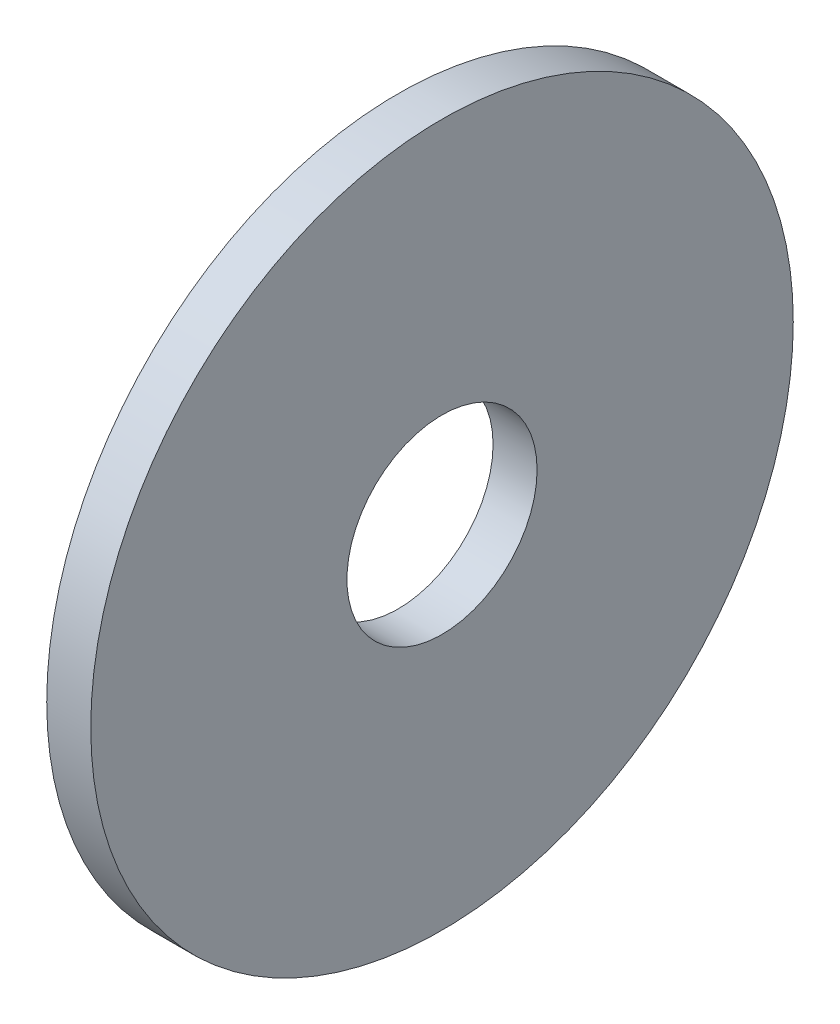
ISO-10303-21;
HEADER;
FILE_DESCRIPTION(('STEP AP214'),'2;1');
FILE_NAME('part.step','',(''),(''),'','','');
FILE_SCHEMA(('AUTOMOTIVE_DESIGN { 1 0 10303 214 1 1 1 1 }'));
ENDSEC;
DATA;
#1=APPLICATION_CONTEXT('core data for automotive mechanical design processes');
#2=APPLICATION_PROTOCOL_DEFINITION('international standard','automotive_design',2000,#1);
#3=PRODUCT_CONTEXT('',#1,'mechanical');
#4=PRODUCT('Part','Part','',(#3));
#5=PRODUCT_RELATED_PRODUCT_CATEGORY('part','',(#4));
#6=PRODUCT_DEFINITION_FORMATION('','',#4);
#7=PRODUCT_DEFINITION_CONTEXT('part definition',#1,'design');
#8=PRODUCT_DEFINITION('design','',#6,#7);
#9=PRODUCT_DEFINITION_SHAPE('','',#8);
#10=(LENGTH_UNIT() NAMED_UNIT(*) SI_UNIT(.MILLI.,.METRE.));
#11=(NAMED_UNIT(*) PLANE_ANGLE_UNIT() SI_UNIT($,.RADIAN.));
#12=(NAMED_UNIT(*) SI_UNIT($,.STERADIAN.) SOLID_ANGLE_UNIT());
#13=UNCERTAINTY_MEASURE_WITH_UNIT(LENGTH_MEASURE(1.E-05),#10,'distance_accuracy_value','');
#14=(GEOMETRIC_REPRESENTATION_CONTEXT(3) GLOBAL_UNCERTAINTY_ASSIGNED_CONTEXT((#13)) GLOBAL_UNIT_ASSIGNED_CONTEXT((#10,
#11,#12)) REPRESENTATION_CONTEXT('',''));
#15=CARTESIAN_POINT('',(0.,0.,0.));
#16=DIRECTION('',(0.,0.,1.));
#17=DIRECTION('',(1.,0.,0.));
#18=AXIS2_PLACEMENT_3D('',#15,#16,#17);
#19=CARTESIAN_POINT('',(0.,0.,0.));
#20=DIRECTION('',(1.,0.,0.));
#21=DIRECTION('',(0.,1.,0.));
#22=AXIS2_PLACEMENT_3D('',#19,#20,#21);
#23=PLANE('',#22);
#24=CARTESIAN_POINT('',(0.,0.,0.));
#25=DIRECTION('',(1.,0.,0.));
#26=DIRECTION('',(0.,0.,-1.));
#27=AXIS2_PLACEMENT_3D('',#24,#25,#26);
#28=CIRCLE('',#27,2.5781);
#29=CARTESIAN_POINT('',(0.,0.,-2.5781));
#30=VERTEX_POINT('',#29);
#31=EDGE_CURVE('E58',#30,#30,#28,.T.);
#32=ORIENTED_EDGE('',*,*,#31,.T.);
#33=EDGE_LOOP('',(#32));
#34=FACE_BOUND('',#33,.T.);
#35=CARTESIAN_POINT('',(0.,0.,0.));
#36=DIRECTION('',(1.,0.,0.));
#37=DIRECTION('',(0.,0.,-1.));
#38=AXIS2_PLACEMENT_3D('',#35,#36,#37);
#39=CIRCLE('',#38,9.525);
#40=CARTESIAN_POINT('',(0.,0.,-9.525));
#41=VERTEX_POINT('',#40);
#42=EDGE_CURVE('E63',#41,#41,#39,.T.);
#43=ORIENTED_EDGE('',*,*,#42,.F.);
#44=EDGE_LOOP('',(#43));
#45=FACE_BOUND('',#44,.T.);
#46=ADVANCED_FACE('F17',(#34,#45),#23,.F.);
#47=CARTESIAN_POINT('',(1.1938,0.,0.));
#48=DIRECTION('',(1.,0.,0.));
#49=DIRECTION('',(0.,1.,0.));
#50=AXIS2_PLACEMENT_3D('',#47,#48,#49);
#51=PLANE('',#50);
#52=CARTESIAN_POINT('',(1.1938,0.,0.));
#53=DIRECTION('',(1.,0.,0.));
#54=DIRECTION('',(0.,0.,-1.));
#55=AXIS2_PLACEMENT_3D('',#52,#53,#54);
#56=CIRCLE('',#55,2.5781);
#57=CARTESIAN_POINT('',(1.1938,0.,-2.5781));
#58=VERTEX_POINT('',#57);
#59=EDGE_CURVE('E57',#58,#58,#56,.T.);
#60=ORIENTED_EDGE('',*,*,#59,.F.);
#61=EDGE_LOOP('',(#60));
#62=FACE_BOUND('',#61,.T.);
#63=CARTESIAN_POINT('',(1.1938,0.,0.));
#64=DIRECTION('',(1.,0.,0.));
#65=DIRECTION('',(0.,0.,-1.));
#66=AXIS2_PLACEMENT_3D('',#63,#64,#65);
#67=CIRCLE('',#66,9.525);
#68=CARTESIAN_POINT('',(1.1938,0.,-9.525));
#69=VERTEX_POINT('',#68);
#70=EDGE_CURVE('E11',#69,#69,#67,.T.);
#71=ORIENTED_EDGE('',*,*,#70,.T.);
#72=EDGE_LOOP('',(#71));
#73=FACE_BOUND('',#72,.T.);
#74=ADVANCED_FACE('F75',(#62,#73),#51,.T.);
#75=CARTESIAN_POINT('',(1.1938,0.,0.));
#76=DIRECTION('',(-1.,0.,0.));
#77=DIRECTION('',(0.,0.,1.));
#78=AXIS2_PLACEMENT_3D('',#75,#76,#77);
#79=CYLINDRICAL_SURFACE('',#78,9.525);
#80=ORIENTED_EDGE('',*,*,#42,.T.);
#81=DIRECTION('',(1.,0.,0.));
#82=VECTOR('',#81,1.);
#83=CARTESIAN_POINT('',(1.1938,0.,-9.525));
#84=LINE('',#83,#82);
#85=EDGE_CURVE('E20',#41,#69,#84,.T.);
#86=ORIENTED_EDGE('',*,*,#85,.T.);
#87=ORIENTED_EDGE('',*,*,#70,.F.);
#88=ORIENTED_EDGE('',*,*,#85,.F.);
#89=EDGE_LOOP('',(#80,#86,#87,#88));
#90=FACE_BOUND('',#89,.T.);
#91=ADVANCED_FACE('F73',(#90),#79,.T.);
#92=CARTESIAN_POINT('',(1.1938,0.,0.));
#93=DIRECTION('',(-1.,0.,0.));
#94=DIRECTION('',(0.,0.,1.));
#95=AXIS2_PLACEMENT_3D('',#92,#93,#94);
#96=CYLINDRICAL_SURFACE('',#95,2.5781);
#97=ORIENTED_EDGE('',*,*,#59,.T.);
#98=DIRECTION('',(-1.,0.,0.));
#99=VECTOR('',#98,1.);
#100=CARTESIAN_POINT('',(1.1938,0.,-2.5781));
#101=LINE('',#100,#99);
#102=EDGE_CURVE('E54',#58,#30,#101,.T.);
#103=ORIENTED_EDGE('',*,*,#102,.T.);
#104=ORIENTED_EDGE('',*,*,#31,.F.);
#105=ORIENTED_EDGE('',*,*,#102,.F.);
#106=EDGE_LOOP('',(#97,#103,#104,#105));
#107=FACE_BOUND('',#106,.T.);
#108=ADVANCED_FACE('F55',(#107),#96,.F.);
#109=CLOSED_SHELL('',(#46,#74,#91,#108));
#110=MANIFOLD_SOLID_BREP('B1',#109);
#111=ADVANCED_BREP_SHAPE_REPRESENTATION('',(#18,#110),#14);
#112=SHAPE_DEFINITION_REPRESENTATION(#9,#111);
ENDSEC;
END-ISO-10303-21;
